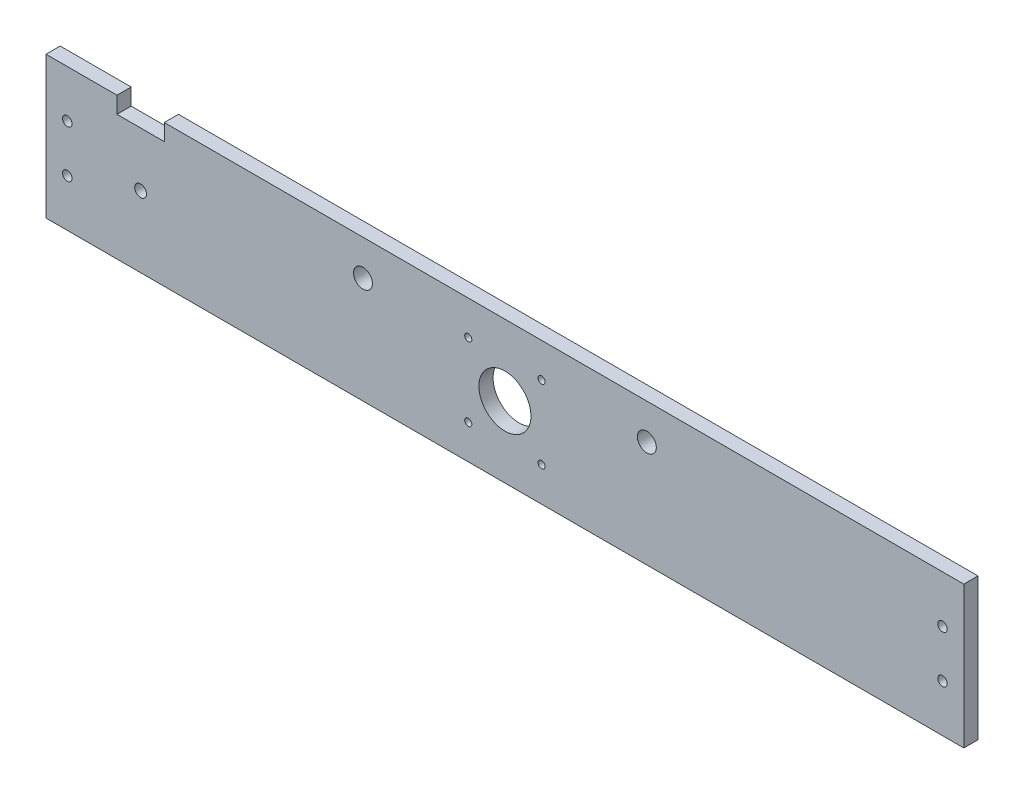
ISO-10303-21;
HEADER;
FILE_DESCRIPTION(('STEP AP214'),'2;1');
FILE_NAME('part.step','',(''),(''),'','','');
FILE_SCHEMA(('AUTOMOTIVE_DESIGN { 1 0 10303 214 1 1 1 1 }'));
ENDSEC;
DATA;
#1=APPLICATION_CONTEXT('core data for automotive mechanical design processes');
#2=APPLICATION_PROTOCOL_DEFINITION('international standard','automotive_design',2000,#1);
#3=PRODUCT_CONTEXT('',#1,'mechanical');
#4=PRODUCT('Part','Part','',(#3));
#5=PRODUCT_RELATED_PRODUCT_CATEGORY('part','',(#4));
#6=PRODUCT_DEFINITION_FORMATION('','',#4);
#7=PRODUCT_DEFINITION_CONTEXT('part definition',#1,'design');
#8=PRODUCT_DEFINITION('design','',#6,#7);
#9=PRODUCT_DEFINITION_SHAPE('','',#8);
#10=(LENGTH_UNIT() NAMED_UNIT(*) SI_UNIT(.MILLI.,.METRE.));
#11=(NAMED_UNIT(*) PLANE_ANGLE_UNIT() SI_UNIT($,.RADIAN.));
#12=(NAMED_UNIT(*) SI_UNIT($,.STERADIAN.) SOLID_ANGLE_UNIT());
#13=UNCERTAINTY_MEASURE_WITH_UNIT(LENGTH_MEASURE(1.E-05),#10,'distance_accuracy_value','');
#14=(GEOMETRIC_REPRESENTATION_CONTEXT(3) GLOBAL_UNCERTAINTY_ASSIGNED_CONTEXT((#13)) GLOBAL_UNIT_ASSIGNED_CONTEXT((#10,
#11,#12)) REPRESENTATION_CONTEXT('',''));
#15=CARTESIAN_POINT('',(0.,0.,0.));
#16=DIRECTION('',(0.,0.,1.));
#17=DIRECTION('',(1.,0.,0.));
#18=AXIS2_PLACEMENT_3D('',#15,#16,#17);
#19=CARTESIAN_POINT('',(0.,30.,6.));
#20=DIRECTION('',(0.,1.,0.));
#21=DIRECTION('',(0.,0.,1.));
#22=AXIS2_PLACEMENT_3D('',#19,#20,#21);
#23=PLANE('',#22);
#24=DIRECTION('',(1.,0.,0.));
#25=VECTOR('',#24,1.);
#26=CARTESIAN_POINT('',(0.,30.,0.));
#27=LINE('',#26,#25);
#28=CARTESIAN_POINT('',(-144.,30.,0.));
#29=VERTEX_POINT('',#28);
#30=CARTESIAN_POINT('',(194.,30.,0.));
#31=VERTEX_POINT('',#30);
#32=EDGE_CURVE('E163',#29,#31,#27,.T.);
#33=ORIENTED_EDGE('',*,*,#32,.F.);
#34=DIRECTION('',(0.,0.,-1.));
#35=VECTOR('',#34,1.);
#36=CARTESIAN_POINT('',(-144.,30.,6.));
#37=LINE('',#36,#35);
#38=CARTESIAN_POINT('',(-144.,30.,6.));
#39=VERTEX_POINT('',#38);
#40=EDGE_CURVE('E13',#39,#29,#37,.T.);
#41=ORIENTED_EDGE('',*,*,#40,.F.);
#42=DIRECTION('',(1.,0.,0.));
#43=VECTOR('',#42,1.);
#44=CARTESIAN_POINT('',(0.,30.,6.));
#45=LINE('',#44,#43);
#46=CARTESIAN_POINT('',(194.,30.,6.));
#47=VERTEX_POINT('',#46);
#48=EDGE_CURVE('E225',#39,#47,#45,.T.);
#49=ORIENTED_EDGE('',*,*,#48,.T.);
#50=DIRECTION('',(0.,0.,-1.));
#51=VECTOR('',#50,1.);
#52=CARTESIAN_POINT('',(194.,30.,6.));
#53=LINE('',#52,#51);
#54=EDGE_CURVE('E64',#47,#31,#53,.T.);
#55=ORIENTED_EDGE('',*,*,#54,.T.);
#56=EDGE_LOOP('',(#33,#41,#49,#55));
#57=FACE_BOUND('',#56,.T.);
#58=ADVANCED_FACE('F47',(#57),#23,.T.);
#59=CARTESIAN_POINT('',(-144.,0.,6.));
#60=DIRECTION('',(1.,0.,0.));
#61=DIRECTION('',(0.,0.,-1.));
#62=AXIS2_PLACEMENT_3D('',#59,#60,#61);
#63=PLANE('',#62);
#64=DIRECTION('',(0.,-1.,0.));
#65=VECTOR('',#64,1.);
#66=CARTESIAN_POINT('',(-144.,0.,0.));
#67=LINE('',#66,#65);
#68=CARTESIAN_POINT('',(-144.,23.,0.));
#69=VERTEX_POINT('',#68);
#70=EDGE_CURVE('E160',#29,#69,#67,.T.);
#71=ORIENTED_EDGE('',*,*,#70,.T.);
#72=DIRECTION('',(0.,0.,-1.));
#73=VECTOR('',#72,1.);
#74=CARTESIAN_POINT('',(-144.,23.,6.));
#75=LINE('',#74,#73);
#76=CARTESIAN_POINT('',(-144.,23.,6.));
#77=VERTEX_POINT('',#76);
#78=EDGE_CURVE('E56',#77,#69,#75,.T.);
#79=ORIENTED_EDGE('',*,*,#78,.F.);
#80=DIRECTION('',(0.,-1.,0.));
#81=VECTOR('',#80,1.);
#82=CARTESIAN_POINT('',(-144.,0.,6.));
#83=LINE('',#82,#81);
#84=EDGE_CURVE('E222',#39,#77,#83,.T.);
#85=ORIENTED_EDGE('',*,*,#84,.F.);
#86=ORIENTED_EDGE('',*,*,#40,.T.);
#87=EDGE_LOOP('',(#71,#79,#85,#86));
#88=FACE_BOUND('',#87,.T.);
#89=ADVANCED_FACE('F161',(#88),#63,.F.);
#90=CARTESIAN_POINT('',(0.,23.,6.));
#91=DIRECTION('',(0.,1.,0.));
#92=DIRECTION('',(0.,0.,1.));
#93=AXIS2_PLACEMENT_3D('',#90,#91,#92);
#94=PLANE('',#93);
#95=DIRECTION('',(1.,0.,0.));
#96=VECTOR('',#95,1.);
#97=CARTESIAN_POINT('',(0.,23.,0.));
#98=LINE('',#97,#96);
#99=CARTESIAN_POINT('',(-164.,23.,0.));
#100=VERTEX_POINT('',#99);
#101=EDGE_CURVE('E154',#100,#69,#98,.T.);
#102=ORIENTED_EDGE('',*,*,#101,.F.);
#103=DIRECTION('',(0.,0.,-1.));
#104=VECTOR('',#103,1.);
#105=CARTESIAN_POINT('',(-164.,23.,6.));
#106=LINE('',#105,#104);
#107=CARTESIAN_POINT('',(-164.,23.,6.));
#108=VERTEX_POINT('',#107);
#109=EDGE_CURVE('E146',#108,#100,#106,.T.);
#110=ORIENTED_EDGE('',*,*,#109,.F.);
#111=DIRECTION('',(1.,0.,0.));
#112=VECTOR('',#111,1.);
#113=CARTESIAN_POINT('',(0.,23.,6.));
#114=LINE('',#113,#112);
#115=EDGE_CURVE('E157',#108,#77,#114,.T.);
#116=ORIENTED_EDGE('',*,*,#115,.T.);
#117=ORIENTED_EDGE('',*,*,#78,.T.);
#118=EDGE_LOOP('',(#102,#110,#116,#117));
#119=FACE_BOUND('',#118,.T.);
#120=ADVANCED_FACE('F152',(#119),#94,.T.);
#121=CARTESIAN_POINT('',(-164.,0.,6.));
#122=DIRECTION('',(1.,0.,0.));
#123=DIRECTION('',(0.,0.,-1.));
#124=AXIS2_PLACEMENT_3D('',#121,#122,#123);
#125=PLANE('',#124);
#126=DIRECTION('',(0.,-1.,0.));
#127=VECTOR('',#126,1.);
#128=CARTESIAN_POINT('',(-164.,0.,0.));
#129=LINE('',#128,#127);
#130=CARTESIAN_POINT('',(-164.,30.,0.));
#131=VERTEX_POINT('',#130);
#132=EDGE_CURVE('E169',#131,#100,#129,.T.);
#133=ORIENTED_EDGE('',*,*,#132,.F.);
#134=DIRECTION('',(0.,0.,-1.));
#135=VECTOR('',#134,1.);
#136=CARTESIAN_POINT('',(-164.,30.,6.));
#137=LINE('',#136,#135);
#138=CARTESIAN_POINT('',(-164.,30.,6.));
#139=VERTEX_POINT('',#138);
#140=EDGE_CURVE('E140',#139,#131,#137,.T.);
#141=ORIENTED_EDGE('',*,*,#140,.F.);
#142=DIRECTION('',(0.,-1.,0.));
#143=VECTOR('',#142,1.);
#144=CARTESIAN_POINT('',(-164.,0.,6.));
#145=LINE('',#144,#143);
#146=EDGE_CURVE('E221',#139,#108,#145,.T.);
#147=ORIENTED_EDGE('',*,*,#146,.T.);
#148=ORIENTED_EDGE('',*,*,#109,.T.);
#149=EDGE_LOOP('',(#133,#141,#147,#148));
#150=FACE_BOUND('',#149,.T.);
#151=ADVANCED_FACE('F220',(#150),#125,.T.);
#152=CARTESIAN_POINT('',(-194.,30.,0.));
#153=VERTEX_POINT('',#152);
#154=EDGE_CURVE('E171',#153,#131,#27,.T.);
#155=ORIENTED_EDGE('',*,*,#154,.F.);
#156=DIRECTION('',(0.,0.,-1.));
#157=VECTOR('',#156,1.);
#158=CARTESIAN_POINT('',(-194.,30.,6.));
#159=LINE('',#158,#157);
#160=CARTESIAN_POINT('',(-194.,30.,6.));
#161=VERTEX_POINT('',#160);
#162=EDGE_CURVE('E138',#161,#153,#159,.T.);
#163=ORIENTED_EDGE('',*,*,#162,.F.);
#164=EDGE_CURVE('E132',#161,#139,#45,.T.);
#165=ORIENTED_EDGE('',*,*,#164,.T.);
#166=ORIENTED_EDGE('',*,*,#140,.T.);
#167=EDGE_LOOP('',(#155,#163,#165,#166));
#168=FACE_BOUND('',#167,.T.);
#169=ADVANCED_FACE('F217',(#168),#23,.T.);
#170=CARTESIAN_POINT('',(-194.,0.,6.));
#171=DIRECTION('',(1.,0.,0.));
#172=DIRECTION('',(0.,0.,-1.));
#173=AXIS2_PLACEMENT_3D('',#170,#171,#172);
#174=PLANE('',#173);
#175=DIRECTION('',(0.,-1.,0.));
#176=VECTOR('',#175,1.);
#177=CARTESIAN_POINT('',(-194.,0.,0.));
#178=LINE('',#177,#176);
#179=CARTESIAN_POINT('',(-194.,-30.,0.));
#180=VERTEX_POINT('',#179);
#181=EDGE_CURVE('E137',#153,#180,#178,.T.);
#182=ORIENTED_EDGE('',*,*,#181,.T.);
#183=DIRECTION('',(0.,0.,-1.));
#184=VECTOR('',#183,1.);
#185=CARTESIAN_POINT('',(-194.,-30.,6.));
#186=LINE('',#185,#184);
#187=CARTESIAN_POINT('',(-194.,-30.,6.));
#188=VERTEX_POINT('',#187);
#189=EDGE_CURVE('E118',#188,#180,#186,.T.);
#190=ORIENTED_EDGE('',*,*,#189,.F.);
#191=DIRECTION('',(0.,-1.,0.));
#192=VECTOR('',#191,1.);
#193=CARTESIAN_POINT('',(-194.,0.,6.));
#194=LINE('',#193,#192);
#195=EDGE_CURVE('E123',#161,#188,#194,.T.);
#196=ORIENTED_EDGE('',*,*,#195,.F.);
#197=ORIENTED_EDGE('',*,*,#162,.T.);
#198=EDGE_LOOP('',(#182,#190,#196,#197));
#199=FACE_BOUND('',#198,.T.);
#200=ADVANCED_FACE('F135',(#199),#174,.F.);
#201=CARTESIAN_POINT('',(0.,-30.,6.));
#202=DIRECTION('',(0.,1.,0.));
#203=DIRECTION('',(0.,0.,1.));
#204=AXIS2_PLACEMENT_3D('',#201,#202,#203);
#205=PLANE('',#204);
#206=DIRECTION('',(1.,0.,0.));
#207=VECTOR('',#206,1.);
#208=CARTESIAN_POINT('',(0.,-30.,0.));
#209=LINE('',#208,#207);
#210=CARTESIAN_POINT('',(194.,-30.,0.));
#211=VERTEX_POINT('',#210);
#212=EDGE_CURVE('E176',#180,#211,#209,.T.);
#213=ORIENTED_EDGE('',*,*,#212,.T.);
#214=DIRECTION('',(0.,0.,-1.));
#215=VECTOR('',#214,1.);
#216=CARTESIAN_POINT('',(194.,-30.,6.));
#217=LINE('',#216,#215);
#218=CARTESIAN_POINT('',(194.,-30.,6.));
#219=VERTEX_POINT('',#218);
#220=EDGE_CURVE('E90',#219,#211,#217,.T.);
#221=ORIENTED_EDGE('',*,*,#220,.F.);
#222=DIRECTION('',(1.,0.,0.));
#223=VECTOR('',#222,1.);
#224=CARTESIAN_POINT('',(0.,-30.,6.));
#225=LINE('',#224,#223);
#226=EDGE_CURVE('E114',#188,#219,#225,.T.);
#227=ORIENTED_EDGE('',*,*,#226,.F.);
#228=ORIENTED_EDGE('',*,*,#189,.T.);
#229=EDGE_LOOP('',(#213,#221,#227,#228));
#230=FACE_BOUND('',#229,.T.);
#231=ADVANCED_FACE('F116',(#230),#205,.F.);
#232=CARTESIAN_POINT('',(-185.,-10.0000000000013,6.));
#233=DIRECTION('',(0.,0.,-1.));
#234=DIRECTION('',(-1.,0.,0.));
#235=AXIS2_PLACEMENT_3D('',#232,#233,#234);
#236=CYLINDRICAL_SURFACE('',#235,1.99999999999994);
#237=CARTESIAN_POINT('',(-185.,-10.0000000000013,6.));
#238=DIRECTION('',(0.,0.,1.));
#239=DIRECTION('',(1.,0.,0.));
#240=AXIS2_PLACEMENT_3D('',#237,#238,#239);
#241=CIRCLE('',#240,1.99999999999994);
#242=CARTESIAN_POINT('',(-183.,-10.0000000000013,6.));
#243=VERTEX_POINT('',#242);
#244=EDGE_CURVE('E189',#243,#243,#241,.T.);
#245=ORIENTED_EDGE('',*,*,#244,.T.);
#246=EDGE_LOOP('',(#245));
#247=FACE_BOUND('',#246,.T.);
#248=CARTESIAN_POINT('',(-185.,-10.0000000000013,0.));
#249=DIRECTION('',(0.,0.,1.));
#250=DIRECTION('',(1.,0.,0.));
#251=AXIS2_PLACEMENT_3D('',#248,#249,#250);
#252=CIRCLE('',#251,1.99999999999994);
#253=CARTESIAN_POINT('',(-183.,-10.0000000000013,0.));
#254=VERTEX_POINT('',#253);
#255=EDGE_CURVE('E181',#254,#254,#252,.T.);
#256=ORIENTED_EDGE('',*,*,#255,.F.);
#257=EDGE_LOOP('',(#256));
#258=FACE_BOUND('',#257,.T.);
#259=ADVANCED_FACE('F370',(#247,#258),#236,.F.);
#260=CARTESIAN_POINT('',(194.,0.,6.));
#261=DIRECTION('',(1.,0.,0.));
#262=DIRECTION('',(0.,0.,-1.));
#263=AXIS2_PLACEMENT_3D('',#260,#261,#262);
#264=PLANE('',#263);
#265=DIRECTION('',(0.,-1.,0.));
#266=VECTOR('',#265,1.);
#267=CARTESIAN_POINT('',(194.,0.,0.));
#268=LINE('',#267,#266);
#269=EDGE_CURVE('E178',#31,#211,#268,.T.);
#270=ORIENTED_EDGE('',*,*,#269,.F.);
#271=ORIENTED_EDGE('',*,*,#54,.F.);
#272=DIRECTION('',(0.,-1.,0.));
#273=VECTOR('',#272,1.);
#274=CARTESIAN_POINT('',(194.,0.,6.));
#275=LINE('',#274,#273);
#276=EDGE_CURVE('E122',#47,#219,#275,.T.);
#277=ORIENTED_EDGE('',*,*,#276,.T.);
#278=ORIENTED_EDGE('',*,*,#220,.T.);
#279=EDGE_LOOP('',(#270,#271,#277,#278));
#280=FACE_BOUND('',#279,.T.);
#281=ADVANCED_FACE('F228',(#280),#264,.T.);
#282=CARTESIAN_POINT('',(59.9999999999998,14.9999999999999,6.));
#283=DIRECTION('',(0.,0.,-1.));
#284=DIRECTION('',(-1.,0.,0.));
#285=AXIS2_PLACEMENT_3D('',#282,#283,#284);
#286=CYLINDRICAL_SURFACE('',#285,4.00000000000001);
#287=CARTESIAN_POINT('',(59.9999999999998,14.9999999999999,6.));
#288=DIRECTION('',(0.,0.,1.));
#289=DIRECTION('',(1.,0.,0.));
#290=AXIS2_PLACEMENT_3D('',#287,#288,#289);
#291=CIRCLE('',#290,4.00000000000001);
#292=CARTESIAN_POINT('',(63.9999999999998,14.9999999999999,6.));
#293=VERTEX_POINT('',#292);
#294=EDGE_CURVE('E229',#293,#293,#291,.T.);
#295=ORIENTED_EDGE('',*,*,#294,.T.);
#296=EDGE_LOOP('',(#295));
#297=FACE_BOUND('',#296,.T.);
#298=CARTESIAN_POINT('',(59.9999999999998,14.9999999999999,0.));
#299=DIRECTION('',(0.,0.,1.));
#300=DIRECTION('',(1.,0.,0.));
#301=AXIS2_PLACEMENT_3D('',#298,#299,#300);
#302=CIRCLE('',#301,4.00000000000001);
#303=CARTESIAN_POINT('',(63.9999999999998,14.9999999999999,0.));
#304=VERTEX_POINT('',#303);
#305=EDGE_CURVE('E213',#304,#304,#302,.T.);
#306=ORIENTED_EDGE('',*,*,#305,.F.);
#307=EDGE_LOOP('',(#306));
#308=FACE_BOUND('',#307,.T.);
#309=ADVANCED_FACE('F293',(#297,#308),#286,.F.);
#310=CARTESIAN_POINT('',(-60.,14.9999999999999,6.));
#311=DIRECTION('',(0.,0.,-1.));
#312=DIRECTION('',(-1.,0.,0.));
#313=AXIS2_PLACEMENT_3D('',#310,#311,#312);
#314=CYLINDRICAL_SURFACE('',#313,4.00000000000001);
#315=CARTESIAN_POINT('',(-60.,14.9999999999999,6.));
#316=DIRECTION('',(0.,0.,1.));
#317=DIRECTION('',(1.,0.,0.));
#318=AXIS2_PLACEMENT_3D('',#315,#316,#317);
#319=CIRCLE('',#318,4.00000000000001);
#320=CARTESIAN_POINT('',(-56.,14.9999999999999,6.));
#321=VERTEX_POINT('',#320);
#322=EDGE_CURVE('E231',#321,#321,#319,.T.);
#323=ORIENTED_EDGE('',*,*,#322,.T.);
#324=EDGE_LOOP('',(#323));
#325=FACE_BOUND('',#324,.T.);
#326=CARTESIAN_POINT('',(-60.,14.9999999999999,0.));
#327=DIRECTION('',(0.,0.,1.));
#328=DIRECTION('',(1.,0.,0.));
#329=AXIS2_PLACEMENT_3D('',#326,#327,#328);
#330=CIRCLE('',#329,4.00000000000001);
#331=CARTESIAN_POINT('',(-56.,14.9999999999999,0.));
#332=VERTEX_POINT('',#331);
#333=EDGE_CURVE('E210',#332,#332,#330,.T.);
#334=ORIENTED_EDGE('',*,*,#333,.F.);
#335=EDGE_LOOP('',(#334));
#336=FACE_BOUND('',#335,.T.);
#337=ADVANCED_FACE('F296',(#325,#336),#314,.F.);
#338=CARTESIAN_POINT('',(0.,0.,6.));
#339=DIRECTION('',(0.,0.,-1.));
#340=DIRECTION('',(-1.,0.,0.));
#341=AXIS2_PLACEMENT_3D('',#338,#339,#340);
#342=CYLINDRICAL_SURFACE('',#341,11.);
#343=CARTESIAN_POINT('',(0.,0.,6.));
#344=DIRECTION('',(0.,0.,1.));
#345=DIRECTION('',(1.,0.,0.));
#346=AXIS2_PLACEMENT_3D('',#343,#344,#345);
#347=CIRCLE('',#346,11.);
#348=CARTESIAN_POINT('',(11.,0.,6.));
#349=VERTEX_POINT('',#348);
#350=EDGE_CURVE('E236',#349,#349,#347,.T.);
#351=ORIENTED_EDGE('',*,*,#350,.T.);
#352=EDGE_LOOP('',(#351));
#353=FACE_BOUND('',#352,.T.);
#354=CARTESIAN_POINT('',(0.,0.,0.));
#355=DIRECTION('',(0.,0.,1.));
#356=DIRECTION('',(1.,0.,0.));
#357=AXIS2_PLACEMENT_3D('',#354,#355,#356);
#358=CIRCLE('',#357,11.);
#359=CARTESIAN_POINT('',(11.,0.,0.));
#360=VERTEX_POINT('',#359);
#361=EDGE_CURVE('E207',#360,#360,#358,.T.);
#362=ORIENTED_EDGE('',*,*,#361,.F.);
#363=EDGE_LOOP('',(#362));
#364=FACE_BOUND('',#363,.T.);
#365=ADVANCED_FACE('F332',(#353,#364),#342,.F.);
#366=CARTESIAN_POINT('',(185.,9.99999999999998,6.));
#367=DIRECTION('',(0.,0.,-1.));
#368=DIRECTION('',(-1.,0.,0.));
#369=AXIS2_PLACEMENT_3D('',#366,#367,#368);
#370=CYLINDRICAL_SURFACE('',#369,2.);
#371=CARTESIAN_POINT('',(185.,9.99999999999998,6.));
#372=DIRECTION('',(0.,0.,1.));
#373=DIRECTION('',(1.,0.,0.));
#374=AXIS2_PLACEMENT_3D('',#371,#372,#373);
#375=CIRCLE('',#374,2.);
#376=CARTESIAN_POINT('',(187.,9.99999999999998,6.));
#377=VERTEX_POINT('',#376);
#378=EDGE_CURVE('E239',#377,#377,#375,.T.);
#379=ORIENTED_EDGE('',*,*,#378,.T.);
#380=EDGE_LOOP('',(#379));
#381=FACE_BOUND('',#380,.T.);
#382=CARTESIAN_POINT('',(185.,9.99999999999998,0.));
#383=DIRECTION('',(0.,0.,1.));
#384=DIRECTION('',(1.,0.,0.));
#385=AXIS2_PLACEMENT_3D('',#382,#383,#384);
#386=CIRCLE('',#385,2.);
#387=CARTESIAN_POINT('',(187.,9.99999999999998,0.));
#388=VERTEX_POINT('',#387);
#389=EDGE_CURVE('E204',#388,#388,#386,.T.);
#390=ORIENTED_EDGE('',*,*,#389,.F.);
#391=EDGE_LOOP('',(#390));
#392=FACE_BOUND('',#391,.T.);
#393=ADVANCED_FACE('F336',(#381,#392),#370,.F.);
#394=CARTESIAN_POINT('',(185.,-9.99999999999996,6.));
#395=DIRECTION('',(0.,0.,-1.));
#396=DIRECTION('',(-1.,0.,0.));
#397=AXIS2_PLACEMENT_3D('',#394,#395,#396);
#398=CYLINDRICAL_SURFACE('',#397,2.);
#399=CARTESIAN_POINT('',(185.,-9.99999999999996,6.));
#400=DIRECTION('',(0.,0.,1.));
#401=DIRECTION('',(1.,0.,0.));
#402=AXIS2_PLACEMENT_3D('',#399,#400,#401);
#403=CIRCLE('',#402,2.);
#404=CARTESIAN_POINT('',(187.,-9.99999999999996,6.));
#405=VERTEX_POINT('',#404);
#406=EDGE_CURVE('E242',#405,#405,#403,.F.);
#407=ORIENTED_EDGE('',*,*,#406,.F.);
#408=EDGE_LOOP('',(#407));
#409=FACE_BOUND('',#408,.T.);
#410=CARTESIAN_POINT('',(185.,-9.99999999999996,0.));
#411=DIRECTION('',(0.,0.,1.));
#412=DIRECTION('',(1.,0.,0.));
#413=AXIS2_PLACEMENT_3D('',#410,#411,#412);
#414=CIRCLE('',#413,2.);
#415=CARTESIAN_POINT('',(187.,-9.99999999999996,0.));
#416=VERTEX_POINT('',#415);
#417=EDGE_CURVE('E200',#416,#416,#414,.F.);
#418=ORIENTED_EDGE('',*,*,#417,.T.);
#419=EDGE_LOOP('',(#418));
#420=FACE_BOUND('',#419,.T.);
#421=ADVANCED_FACE('F339',(#409,#420),#398,.F.);
#422=CARTESIAN_POINT('',(-154.,0.,6.));
#423=DIRECTION('',(0.,0.,-1.));
#424=DIRECTION('',(-1.,0.,0.));
#425=AXIS2_PLACEMENT_3D('',#422,#423,#424);
#426=CYLINDRICAL_SURFACE('',#425,2.5);
#427=CARTESIAN_POINT('',(-154.,0.,6.));
#428=DIRECTION('',(0.,0.,1.));
#429=DIRECTION('',(1.,0.,0.));
#430=AXIS2_PLACEMENT_3D('',#427,#428,#429);
#431=CIRCLE('',#430,2.5);
#432=CARTESIAN_POINT('',(-151.5,0.,6.));
#433=VERTEX_POINT('',#432);
#434=EDGE_CURVE('E186',#433,#433,#431,.T.);
#435=ORIENTED_EDGE('',*,*,#434,.T.);
#436=EDGE_LOOP('',(#435));
#437=FACE_BOUND('',#436,.T.);
#438=CARTESIAN_POINT('',(-154.,0.,0.));
#439=DIRECTION('',(0.,0.,1.));
#440=DIRECTION('',(1.,0.,0.));
#441=AXIS2_PLACEMENT_3D('',#438,#439,#440);
#442=CIRCLE('',#441,2.5);
#443=CARTESIAN_POINT('',(-151.5,0.,0.));
#444=VERTEX_POINT('',#443);
#445=EDGE_CURVE('E197',#444,#444,#442,.T.);
#446=ORIENTED_EDGE('',*,*,#445,.F.);
#447=EDGE_LOOP('',(#446));
#448=FACE_BOUND('',#447,.T.);
#449=ADVANCED_FACE('F49',(#437,#448),#426,.F.);
#450=CARTESIAN_POINT('',(-185.,9.99999999999865,6.));
#451=DIRECTION('',(0.,0.,-1.));
#452=DIRECTION('',(-1.,0.,0.));
#453=AXIS2_PLACEMENT_3D('',#450,#451,#452);
#454=CYLINDRICAL_SURFACE('',#453,2.);
#455=CARTESIAN_POINT('',(-185.,9.99999999999865,6.));
#456=DIRECTION('',(0.,0.,1.));
#457=DIRECTION('',(1.,0.,0.));
#458=AXIS2_PLACEMENT_3D('',#455,#456,#457);
#459=CIRCLE('',#458,2.);
#460=CARTESIAN_POINT('',(-183.,9.99999999999865,6.));
#461=VERTEX_POINT('',#460);
#462=EDGE_CURVE('E187',#461,#461,#459,.F.);
#463=ORIENTED_EDGE('',*,*,#462,.F.);
#464=EDGE_LOOP('',(#463));
#465=FACE_BOUND('',#464,.T.);
#466=CARTESIAN_POINT('',(-185.,9.99999999999865,0.));
#467=DIRECTION('',(0.,0.,1.));
#468=DIRECTION('',(1.,0.,0.));
#469=AXIS2_PLACEMENT_3D('',#466,#467,#468);
#470=CIRCLE('',#469,2.);
#471=CARTESIAN_POINT('',(-183.,9.99999999999865,0.));
#472=VERTEX_POINT('',#471);
#473=EDGE_CURVE('E184',#472,#472,#470,.F.);
#474=ORIENTED_EDGE('',*,*,#473,.T.);
#475=EDGE_LOOP('',(#474));
#476=FACE_BOUND('',#475,.T.);
#477=ADVANCED_FACE('F276',(#465,#476),#454,.F.);
#478=CARTESIAN_POINT('',(0.,0.,6.));
#479=DIRECTION('',(0.,0.,1.));
#480=DIRECTION('',(1.,0.,0.));
#481=AXIS2_PLACEMENT_3D('',#478,#479,#480);
#482=PLANE('',#481);
#483=CARTESIAN_POINT('',(-15.4949999999993,15.494999999998,6.));
#484=DIRECTION('',(0.,0.,1.));
#485=DIRECTION('',(-1.,0.,0.));
#486=AXIS2_PLACEMENT_3D('',#483,#484,#485);
#487=CIRCLE('',#486,1.50000000000003);
#488=CARTESIAN_POINT('',(-16.9949999999993,15.494999999998,6.));
#489=VERTEX_POINT('',#488);
#490=EDGE_CURVE('E256',#489,#489,#487,.T.);
#491=ORIENTED_EDGE('',*,*,#490,.F.);
#492=EDGE_LOOP('',(#491));
#493=FACE_BOUND('',#492,.T.);
#494=CARTESIAN_POINT('',(15.4949999999992,-15.494999999998,6.));
#495=DIRECTION('',(0.,0.,1.));
#496=DIRECTION('',(-1.,0.,0.));
#497=AXIS2_PLACEMENT_3D('',#494,#495,#496);
#498=CIRCLE('',#497,1.50000000000002);
#499=CARTESIAN_POINT('',(13.9949999999992,-15.494999999998,6.));
#500=VERTEX_POINT('',#499);
#501=EDGE_CURVE('E257',#500,#500,#498,.T.);
#502=ORIENTED_EDGE('',*,*,#501,.F.);
#503=EDGE_LOOP('',(#502));
#504=FACE_BOUND('',#503,.T.);
#505=CARTESIAN_POINT('',(-15.4949999999993,-15.494999999998,6.));
#506=DIRECTION('',(0.,0.,1.));
#507=DIRECTION('',(1.,0.,0.));
#508=AXIS2_PLACEMENT_3D('',#505,#506,#507);
#509=CIRCLE('',#508,1.50000000000003);
#510=CARTESIAN_POINT('',(-13.9949999999993,-15.494999999998,6.));
#511=VERTEX_POINT('',#510);
#512=EDGE_CURVE('E267',#511,#511,#509,.T.);
#513=ORIENTED_EDGE('',*,*,#512,.F.);
#514=EDGE_LOOP('',(#513));
#515=FACE_BOUND('',#514,.T.);
#516=CARTESIAN_POINT('',(15.4949999999992,15.494999999998,6.));
#517=DIRECTION('',(0.,0.,1.));
#518=DIRECTION('',(1.,0.,0.));
#519=AXIS2_PLACEMENT_3D('',#516,#517,#518);
#520=CIRCLE('',#519,1.50000000000002);
#521=CARTESIAN_POINT('',(16.9949999999992,15.494999999998,6.));
#522=VERTEX_POINT('',#521);
#523=EDGE_CURVE('E249',#522,#522,#520,.T.);
#524=ORIENTED_EDGE('',*,*,#523,.F.);
#525=EDGE_LOOP('',(#524));
#526=FACE_BOUND('',#525,.T.);
#527=ORIENTED_EDGE('',*,*,#434,.F.);
#528=EDGE_LOOP('',(#527));
#529=FACE_BOUND('',#528,.T.);
#530=ORIENTED_EDGE('',*,*,#406,.T.);
#531=EDGE_LOOP('',(#530));
#532=FACE_BOUND('',#531,.T.);
#533=ORIENTED_EDGE('',*,*,#378,.F.);
#534=EDGE_LOOP('',(#533));
#535=FACE_BOUND('',#534,.T.);
#536=ORIENTED_EDGE('',*,*,#350,.F.);
#537=EDGE_LOOP('',(#536));
#538=FACE_BOUND('',#537,.T.);
#539=ORIENTED_EDGE('',*,*,#322,.F.);
#540=EDGE_LOOP('',(#539));
#541=FACE_BOUND('',#540,.T.);
#542=ORIENTED_EDGE('',*,*,#294,.F.);
#543=EDGE_LOOP('',(#542));
#544=FACE_BOUND('',#543,.T.);
#545=ORIENTED_EDGE('',*,*,#48,.F.);
#546=ORIENTED_EDGE('',*,*,#84,.T.);
#547=ORIENTED_EDGE('',*,*,#115,.F.);
#548=ORIENTED_EDGE('',*,*,#146,.F.);
#549=ORIENTED_EDGE('',*,*,#164,.F.);
#550=ORIENTED_EDGE('',*,*,#195,.T.);
#551=ORIENTED_EDGE('',*,*,#226,.T.);
#552=ORIENTED_EDGE('',*,*,#276,.F.);
#553=EDGE_LOOP('',(#545,#546,#547,#548,#549,#550,#551,#552));
#554=FACE_BOUND('',#553,.T.);
#555=ORIENTED_EDGE('',*,*,#244,.F.);
#556=EDGE_LOOP('',(#555));
#557=FACE_BOUND('',#556,.T.);
#558=ORIENTED_EDGE('',*,*,#462,.T.);
#559=EDGE_LOOP('',(#558));
#560=FACE_BOUND('',#559,.T.);
#561=ADVANCED_FACE('F128',(#493,#504,#515,#526,#529,#532,#535,#538,#541,#544,#554,#557,#560),
#482,.T.);
#562=CARTESIAN_POINT('',(0.,0.,0.));
#563=DIRECTION('',(0.,0.,1.));
#564=DIRECTION('',(1.,0.,0.));
#565=AXIS2_PLACEMENT_3D('',#562,#563,#564);
#566=PLANE('',#565);
#567=CARTESIAN_POINT('',(-15.4949999999993,15.494999999998,0.));
#568=DIRECTION('',(0.,0.,1.));
#569=DIRECTION('',(1.,0.,0.));
#570=AXIS2_PLACEMENT_3D('',#567,#568,#569);
#571=CIRCLE('',#570,1.50000000000003);
#572=CARTESIAN_POINT('',(-13.9949999999993,15.494999999998,0.));
#573=VERTEX_POINT('',#572);
#574=EDGE_CURVE('E252',#573,#573,#571,.F.);
#575=ORIENTED_EDGE('',*,*,#574,.F.);
#576=EDGE_LOOP('',(#575));
#577=FACE_BOUND('',#576,.T.);
#578=CARTESIAN_POINT('',(15.4949999999992,-15.494999999998,0.));
#579=DIRECTION('',(0.,0.,1.));
#580=DIRECTION('',(1.,0.,0.));
#581=AXIS2_PLACEMENT_3D('',#578,#579,#580);
#582=CIRCLE('',#581,1.50000000000002);
#583=CARTESIAN_POINT('',(16.9949999999992,-15.494999999998,0.));
#584=VERTEX_POINT('',#583);
#585=EDGE_CURVE('E253',#584,#584,#582,.F.);
#586=ORIENTED_EDGE('',*,*,#585,.F.);
#587=EDGE_LOOP('',(#586));
#588=FACE_BOUND('',#587,.T.);
#589=CARTESIAN_POINT('',(-15.4949999999993,-15.494999999998,0.));
#590=DIRECTION('',(0.,0.,1.));
#591=DIRECTION('',(1.,0.,0.));
#592=AXIS2_PLACEMENT_3D('',#589,#590,#591);
#593=CIRCLE('',#592,1.50000000000003);
#594=CARTESIAN_POINT('',(-13.9949999999993,-15.494999999998,0.));
#595=VERTEX_POINT('',#594);
#596=EDGE_CURVE('E260',#595,#595,#593,.F.);
#597=ORIENTED_EDGE('',*,*,#596,.F.);
#598=EDGE_LOOP('',(#597));
#599=FACE_BOUND('',#598,.T.);
#600=CARTESIAN_POINT('',(15.4949999999992,15.494999999998,0.));
#601=DIRECTION('',(0.,0.,1.));
#602=DIRECTION('',(1.,0.,0.));
#603=AXIS2_PLACEMENT_3D('',#600,#601,#602);
#604=CIRCLE('',#603,1.50000000000002);
#605=CARTESIAN_POINT('',(16.9949999999992,15.494999999998,0.));
#606=VERTEX_POINT('',#605);
#607=EDGE_CURVE('E201',#606,#606,#604,.F.);
#608=ORIENTED_EDGE('',*,*,#607,.F.);
#609=EDGE_LOOP('',(#608));
#610=FACE_BOUND('',#609,.T.);
#611=ORIENTED_EDGE('',*,*,#445,.T.);
#612=EDGE_LOOP('',(#611));
#613=FACE_BOUND('',#612,.T.);
#614=ORIENTED_EDGE('',*,*,#417,.F.);
#615=EDGE_LOOP('',(#614));
#616=FACE_BOUND('',#615,.T.);
#617=ORIENTED_EDGE('',*,*,#389,.T.);
#618=EDGE_LOOP('',(#617));
#619=FACE_BOUND('',#618,.T.);
#620=ORIENTED_EDGE('',*,*,#361,.T.);
#621=EDGE_LOOP('',(#620));
#622=FACE_BOUND('',#621,.T.);
#623=ORIENTED_EDGE('',*,*,#333,.T.);
#624=EDGE_LOOP('',(#623));
#625=FACE_BOUND('',#624,.T.);
#626=ORIENTED_EDGE('',*,*,#305,.T.);
#627=EDGE_LOOP('',(#626));
#628=FACE_BOUND('',#627,.T.);
#629=ORIENTED_EDGE('',*,*,#32,.T.);
#630=ORIENTED_EDGE('',*,*,#269,.T.);
#631=ORIENTED_EDGE('',*,*,#212,.F.);
#632=ORIENTED_EDGE('',*,*,#181,.F.);
#633=ORIENTED_EDGE('',*,*,#154,.T.);
#634=ORIENTED_EDGE('',*,*,#132,.T.);
#635=ORIENTED_EDGE('',*,*,#101,.T.);
#636=ORIENTED_EDGE('',*,*,#70,.F.);
#637=EDGE_LOOP('',(#629,#630,#631,#632,#633,#634,#635,#636));
#638=FACE_BOUND('',#637,.T.);
#639=ORIENTED_EDGE('',*,*,#255,.T.);
#640=EDGE_LOOP('',(#639));
#641=FACE_BOUND('',#640,.T.);
#642=ORIENTED_EDGE('',*,*,#473,.F.);
#643=EDGE_LOOP('',(#642));
#644=FACE_BOUND('',#643,.T.);
#645=ADVANCED_FACE('F165',(#577,#588,#599,#610,#613,#616,#619,#622,#625,#628,#638,#641,#644),
#566,.F.);
#646=CARTESIAN_POINT('',(15.4949999999992,15.494999999998,-0.00100000000000013));
#647=DIRECTION('',(0.,0.,1.));
#648=DIRECTION('',(1.,0.,0.));
#649=AXIS2_PLACEMENT_3D('',#646,#647,#648);
#650=CYLINDRICAL_SURFACE('',#649,1.50000000000002);
#651=ORIENTED_EDGE('',*,*,#523,.T.);
#652=EDGE_LOOP('',(#651));
#653=FACE_BOUND('',#652,.T.);
#654=ORIENTED_EDGE('',*,*,#607,.T.);
#655=EDGE_LOOP('',(#654));
#656=FACE_BOUND('',#655,.T.);
#657=ADVANCED_FACE('F301',(#653,#656),#650,.F.);
#658=CARTESIAN_POINT('',(-15.4949999999993,-15.494999999998,-0.00100000000000013));
#659=DIRECTION('',(0.,0.,1.));
#660=DIRECTION('',(1.,0.,0.));
#661=AXIS2_PLACEMENT_3D('',#658,#659,#660);
#662=CYLINDRICAL_SURFACE('',#661,1.50000000000003);
#663=ORIENTED_EDGE('',*,*,#512,.T.);
#664=EDGE_LOOP('',(#663));
#665=FACE_BOUND('',#664,.T.);
#666=ORIENTED_EDGE('',*,*,#596,.T.);
#667=EDGE_LOOP('',(#666));
#668=FACE_BOUND('',#667,.T.);
#669=ADVANCED_FACE('F271',(#665,#668),#662,.F.);
#670=CARTESIAN_POINT('',(15.4949999999992,-15.494999999998,-0.00100000000000013));
#671=DIRECTION('',(0.,0.,1.));
#672=DIRECTION('',(1.,0.,0.));
#673=AXIS2_PLACEMENT_3D('',#670,#671,#672);
#674=CYLINDRICAL_SURFACE('',#673,1.50000000000002);
#675=ORIENTED_EDGE('',*,*,#501,.T.);
#676=EDGE_LOOP('',(#675));
#677=FACE_BOUND('',#676,.T.);
#678=ORIENTED_EDGE('',*,*,#585,.T.);
#679=EDGE_LOOP('',(#678));
#680=FACE_BOUND('',#679,.T.);
#681=ADVANCED_FACE('F442',(#677,#680),#674,.F.);
#682=CARTESIAN_POINT('',(-15.4949999999993,15.494999999998,-0.00100000000000013));
#683=DIRECTION('',(0.,0.,1.));
#684=DIRECTION('',(1.,0.,0.));
#685=AXIS2_PLACEMENT_3D('',#682,#683,#684);
#686=CYLINDRICAL_SURFACE('',#685,1.50000000000003);
#687=ORIENTED_EDGE('',*,*,#490,.T.);
#688=EDGE_LOOP('',(#687));
#689=FACE_BOUND('',#688,.T.);
#690=ORIENTED_EDGE('',*,*,#574,.T.);
#691=EDGE_LOOP('',(#690));
#692=FACE_BOUND('',#691,.T.);
#693=ADVANCED_FACE('F451',(#689,#692),#686,.F.);
#694=CLOSED_SHELL('',(#58,#89,#120,#151,#169,#200,#231,#259,#281,#309,#337,#365,#393,#421,#449,
#477,#561,#645,#657,#669,#681,#693));
#695=MANIFOLD_SOLID_BREP('B2',#694);
#696=ADVANCED_BREP_SHAPE_REPRESENTATION('',(#18,#695),#14);
#697=SHAPE_DEFINITION_REPRESENTATION(#9,#696);
ENDSEC;
END-ISO-10303-21;
